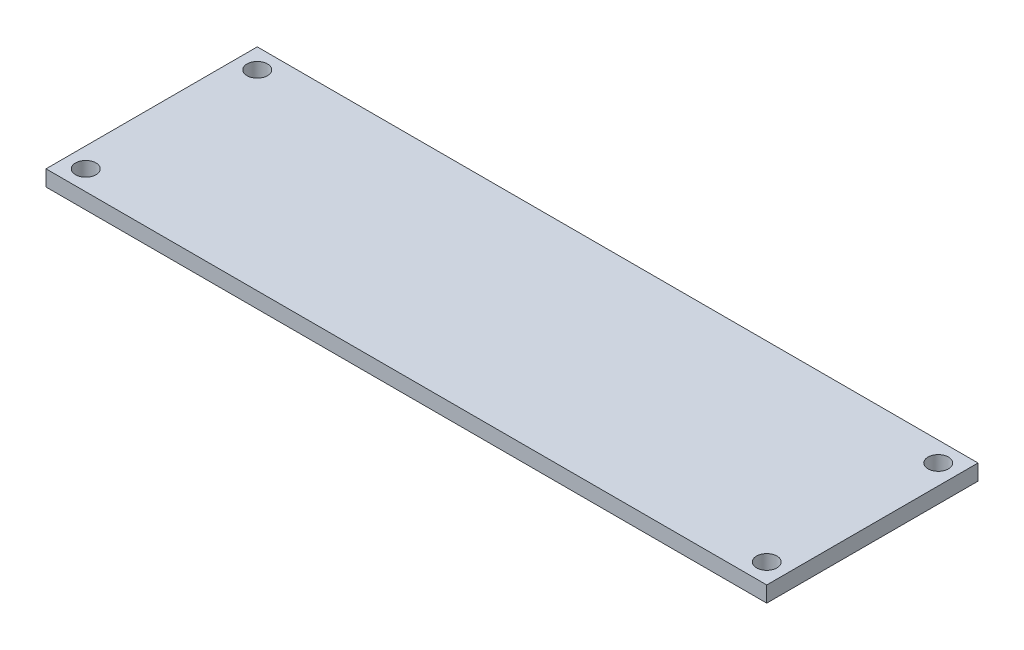
ISO-10303-21;
HEADER;
FILE_DESCRIPTION(('STEP AP214'),'2;1');
FILE_NAME('part.step','',(''),(''),'','','');
FILE_SCHEMA(('AUTOMOTIVE_DESIGN { 1 0 10303 214 1 1 1 1 }'));
ENDSEC;
DATA;
#1=APPLICATION_CONTEXT('core data for automotive mechanical design processes');
#2=APPLICATION_PROTOCOL_DEFINITION('international standard','automotive_design',2000,#1);
#3=PRODUCT_CONTEXT('',#1,'mechanical');
#4=PRODUCT('Part','Part','',(#3));
#5=PRODUCT_RELATED_PRODUCT_CATEGORY('part','',(#4));
#6=PRODUCT_DEFINITION_FORMATION('','',#4);
#7=PRODUCT_DEFINITION_CONTEXT('part definition',#1,'design');
#8=PRODUCT_DEFINITION('design','',#6,#7);
#9=PRODUCT_DEFINITION_SHAPE('','',#8);
#10=(LENGTH_UNIT() NAMED_UNIT(*) SI_UNIT(.MILLI.,.METRE.));
#11=(NAMED_UNIT(*) PLANE_ANGLE_UNIT() SI_UNIT($,.RADIAN.));
#12=(NAMED_UNIT(*) SI_UNIT($,.STERADIAN.) SOLID_ANGLE_UNIT());
#13=UNCERTAINTY_MEASURE_WITH_UNIT(LENGTH_MEASURE(1.E-05),#10,'distance_accuracy_value','');
#14=(GEOMETRIC_REPRESENTATION_CONTEXT(3) GLOBAL_UNCERTAINTY_ASSIGNED_CONTEXT((#13)) GLOBAL_UNIT_ASSIGNED_CONTEXT((#10,
#11,#12)) REPRESENTATION_CONTEXT('',''));
#15=CARTESIAN_POINT('',(0.,0.,0.));
#16=DIRECTION('',(0.,0.,1.));
#17=DIRECTION('',(1.,0.,0.));
#18=AXIS2_PLACEMENT_3D('',#15,#16,#17);
#19=CARTESIAN_POINT('',(-47.1527497782251,-0.635,0.));
#20=DIRECTION('',(0.,1.,0.));
#21=DIRECTION('',(0.,0.,1.));
#22=AXIS2_PLACEMENT_3D('',#19,#20,#21);
#23=PLANE('',#22);
#24=DIRECTION('',(0.,0.,1.));
#25=VECTOR('',#24,1.);
#26=CARTESIAN_POINT('',(-29.,-0.635,0.));
#27=LINE('',#26,#25);
#28=CARTESIAN_POINT('',(-29.,-0.635,-8.5));
#29=VERTEX_POINT('',#28);
#30=CARTESIAN_POINT('',(-29.,-0.635,8.5));
#31=VERTEX_POINT('',#30);
#32=EDGE_CURVE('E206',#29,#31,#27,.T.);
#33=ORIENTED_EDGE('',*,*,#32,.F.);
#34=DIRECTION('',(-1.,0.,0.));
#35=VECTOR('',#34,1.);
#36=CARTESIAN_POINT('',(-47.1527497782251,-0.635,-8.5));
#37=LINE('',#36,#35);
#38=CARTESIAN_POINT('',(29.,-0.635,-8.5));
#39=VERTEX_POINT('',#38);
#40=EDGE_CURVE('E55',#39,#29,#37,.T.);
#41=ORIENTED_EDGE('',*,*,#40,.F.);
#42=DIRECTION('',(0.,0.,1.));
#43=VECTOR('',#42,1.);
#44=CARTESIAN_POINT('',(29.,-0.635,0.));
#45=LINE('',#44,#43);
#46=CARTESIAN_POINT('',(29.,-0.635,8.5));
#47=VERTEX_POINT('',#46);
#48=EDGE_CURVE('E70',#39,#47,#45,.T.);
#49=ORIENTED_EDGE('',*,*,#48,.T.);
#50=DIRECTION('',(-1.,0.,0.));
#51=VECTOR('',#50,1.);
#52=CARTESIAN_POINT('',(-47.1527497782251,-0.635,8.5));
#53=LINE('',#52,#51);
#54=EDGE_CURVE('E60',#47,#31,#53,.T.);
#55=ORIENTED_EDGE('',*,*,#54,.T.);
#56=EDGE_LOOP('',(#33,#41,#49,#55));
#57=FACE_BOUND('',#56,.T.);
#58=CARTESIAN_POINT('',(27.4,-0.635,-6.9));
#59=DIRECTION('',(0.,-1.,0.));
#60=DIRECTION('',(0.,0.,-1.));
#61=AXIS2_PLACEMENT_3D('',#58,#59,#60);
#62=CIRCLE('',#61,0.825000000000001);
#63=CARTESIAN_POINT('',(27.4,-0.635,-7.725));
#64=VERTEX_POINT('',#63);
#65=EDGE_CURVE('E68',#64,#64,#62,.F.);
#66=ORIENTED_EDGE('',*,*,#65,.T.);
#67=EDGE_LOOP('',(#66));
#68=FACE_BOUND('',#67,.T.);
#69=CARTESIAN_POINT('',(27.4,-0.635,6.9));
#70=DIRECTION('',(0.,-1.,0.));
#71=DIRECTION('',(0.,0.,-1.));
#72=AXIS2_PLACEMENT_3D('',#69,#70,#71);
#73=CIRCLE('',#72,0.825000000000001);
#74=CARTESIAN_POINT('',(27.4,-0.635,6.075));
#75=VERTEX_POINT('',#74);
#76=EDGE_CURVE('E97',#75,#75,#73,.F.);
#77=ORIENTED_EDGE('',*,*,#76,.T.);
#78=EDGE_LOOP('',(#77));
#79=FACE_BOUND('',#78,.T.);
#80=CARTESIAN_POINT('',(-27.4,-0.635,-6.9));
#81=DIRECTION('',(0.,-1.,0.));
#82=DIRECTION('',(0.,0.,-1.));
#83=AXIS2_PLACEMENT_3D('',#80,#81,#82);
#84=CIRCLE('',#83,0.825000000000001);
#85=CARTESIAN_POINT('',(-27.4,-0.635,-7.725));
#86=VERTEX_POINT('',#85);
#87=EDGE_CURVE('E99',#86,#86,#84,.F.);
#88=ORIENTED_EDGE('',*,*,#87,.T.);
#89=EDGE_LOOP('',(#88));
#90=FACE_BOUND('',#89,.T.);
#91=CARTESIAN_POINT('',(-27.4,-0.635,6.9));
#92=DIRECTION('',(0.,-1.,0.));
#93=DIRECTION('',(0.,0.,-1.));
#94=AXIS2_PLACEMENT_3D('',#91,#92,#93);
#95=CIRCLE('',#94,0.825000000000001);
#96=CARTESIAN_POINT('',(-27.4,-0.635,6.075));
#97=VERTEX_POINT('',#96);
#98=EDGE_CURVE('E20',#97,#97,#95,.F.);
#99=ORIENTED_EDGE('',*,*,#98,.T.);
#100=EDGE_LOOP('',(#99));
#101=FACE_BOUND('',#100,.T.);
#102=ADVANCED_FACE('F17',(#57,#68,#79,#90,#101),#23,.F.);
#103=CARTESIAN_POINT('',(-27.4,0.635,6.9));
#104=DIRECTION('',(0.,-1.,0.));
#105=DIRECTION('',(0.,0.,-1.));
#106=AXIS2_PLACEMENT_3D('',#103,#104,#105);
#107=CYLINDRICAL_SURFACE('',#106,0.825000000000001);
#108=CARTESIAN_POINT('',(-27.4,0.635,6.9));
#109=DIRECTION('',(0.,-1.,0.));
#110=DIRECTION('',(0.,0.,-1.));
#111=AXIS2_PLACEMENT_3D('',#108,#109,#110);
#112=CIRCLE('',#111,0.825000000000001);
#113=CARTESIAN_POINT('',(-27.4,0.635,6.075));
#114=VERTEX_POINT('',#113);
#115=EDGE_CURVE('E92',#114,#114,#112,.T.);
#116=ORIENTED_EDGE('',*,*,#115,.F.);
#117=EDGE_LOOP('',(#116));
#118=FACE_BOUND('',#117,.T.);
#119=ORIENTED_EDGE('',*,*,#98,.F.);
#120=EDGE_LOOP('',(#119));
#121=FACE_BOUND('',#120,.T.);
#122=ADVANCED_FACE('F107',(#118,#121),#107,.F.);
#123=CARTESIAN_POINT('',(-27.4,0.635,-6.9));
#124=DIRECTION('',(0.,-1.,0.));
#125=DIRECTION('',(0.,0.,-1.));
#126=AXIS2_PLACEMENT_3D('',#123,#124,#125);
#127=CYLINDRICAL_SURFACE('',#126,0.825000000000001);
#128=CARTESIAN_POINT('',(-27.4,0.635,-6.9));
#129=DIRECTION('',(0.,-1.,0.));
#130=DIRECTION('',(0.,0.,-1.));
#131=AXIS2_PLACEMENT_3D('',#128,#129,#130);
#132=CIRCLE('',#131,0.825000000000001);
#133=CARTESIAN_POINT('',(-27.4,0.635,-7.725));
#134=VERTEX_POINT('',#133);
#135=EDGE_CURVE('E89',#134,#134,#132,.T.);
#136=ORIENTED_EDGE('',*,*,#135,.F.);
#137=EDGE_LOOP('',(#136));
#138=FACE_BOUND('',#137,.T.);
#139=ORIENTED_EDGE('',*,*,#87,.F.);
#140=EDGE_LOOP('',(#139));
#141=FACE_BOUND('',#140,.T.);
#142=ADVANCED_FACE('F109',(#138,#141),#127,.F.);
#143=CARTESIAN_POINT('',(27.4,0.635,6.9));
#144=DIRECTION('',(0.,-1.,0.));
#145=DIRECTION('',(0.,0.,-1.));
#146=AXIS2_PLACEMENT_3D('',#143,#144,#145);
#147=CYLINDRICAL_SURFACE('',#146,0.825000000000001);
#148=CARTESIAN_POINT('',(27.4,0.635,6.9));
#149=DIRECTION('',(0.,-1.,0.));
#150=DIRECTION('',(0.,0.,-1.));
#151=AXIS2_PLACEMENT_3D('',#148,#149,#150);
#152=CIRCLE('',#151,0.825000000000001);
#153=CARTESIAN_POINT('',(27.4,0.635,6.075));
#154=VERTEX_POINT('',#153);
#155=EDGE_CURVE('E86',#154,#154,#152,.T.);
#156=ORIENTED_EDGE('',*,*,#155,.F.);
#157=EDGE_LOOP('',(#156));
#158=FACE_BOUND('',#157,.T.);
#159=ORIENTED_EDGE('',*,*,#76,.F.);
#160=EDGE_LOOP('',(#159));
#161=FACE_BOUND('',#160,.T.);
#162=ADVANCED_FACE('F116',(#158,#161),#147,.F.);
#163=CARTESIAN_POINT('',(27.4,0.635,-6.9));
#164=DIRECTION('',(0.,-1.,0.));
#165=DIRECTION('',(0.,0.,-1.));
#166=AXIS2_PLACEMENT_3D('',#163,#164,#165);
#167=CYLINDRICAL_SURFACE('',#166,0.825000000000001);
#168=CARTESIAN_POINT('',(27.4,0.635,-6.9));
#169=DIRECTION('',(0.,-1.,0.));
#170=DIRECTION('',(0.,0.,-1.));
#171=AXIS2_PLACEMENT_3D('',#168,#169,#170);
#172=CIRCLE('',#171,0.825000000000001);
#173=CARTESIAN_POINT('',(27.4,0.635,-7.725));
#174=VERTEX_POINT('',#173);
#175=EDGE_CURVE('E82',#174,#174,#172,.T.);
#176=ORIENTED_EDGE('',*,*,#175,.F.);
#177=EDGE_LOOP('',(#176));
#178=FACE_BOUND('',#177,.T.);
#179=ORIENTED_EDGE('',*,*,#65,.F.);
#180=EDGE_LOOP('',(#179));
#181=FACE_BOUND('',#180,.T.);
#182=ADVANCED_FACE('F140',(#178,#181),#167,.F.);
#183=CARTESIAN_POINT('',(-47.1527497782251,0.635,8.5));
#184=DIRECTION('',(0.,0.,-1.));
#185=DIRECTION('',(-1.,0.,0.));
#186=AXIS2_PLACEMENT_3D('',#183,#184,#185);
#187=PLANE('',#186);
#188=DIRECTION('',(0.,1.,0.));
#189=VECTOR('',#188,1.);
#190=CARTESIAN_POINT('',(29.,0.635,8.5));
#191=LINE('',#190,#189);
#192=CARTESIAN_POINT('',(29.,0.635,8.5));
#193=VERTEX_POINT('',#192);
#194=EDGE_CURVE('E63',#47,#193,#191,.T.);
#195=ORIENTED_EDGE('',*,*,#194,.T.);
#196=DIRECTION('',(1.,0.,0.));
#197=VECTOR('',#196,1.);
#198=CARTESIAN_POINT('',(-47.1527497782251,0.635,8.5));
#199=LINE('',#198,#197);
#200=CARTESIAN_POINT('',(-29.,0.635,8.5));
#201=VERTEX_POINT('',#200);
#202=EDGE_CURVE('E85',#201,#193,#199,.T.);
#203=ORIENTED_EDGE('',*,*,#202,.F.);
#204=DIRECTION('',(0.,1.,0.));
#205=VECTOR('',#204,1.);
#206=CARTESIAN_POINT('',(-29.,0.635,8.5));
#207=LINE('',#206,#205);
#208=EDGE_CURVE('E66',#31,#201,#207,.T.);
#209=ORIENTED_EDGE('',*,*,#208,.F.);
#210=ORIENTED_EDGE('',*,*,#54,.F.);
#211=EDGE_LOOP('',(#195,#203,#209,#210));
#212=FACE_BOUND('',#211,.T.);
#213=ADVANCED_FACE('F61',(#212),#187,.F.);
#214=CARTESIAN_POINT('',(29.,0.635,0.));
#215=DIRECTION('',(-1.,0.,0.));
#216=DIRECTION('',(0.,0.,1.));
#217=AXIS2_PLACEMENT_3D('',#214,#215,#216);
#218=PLANE('',#217);
#219=DIRECTION('',(0.,1.,0.));
#220=VECTOR('',#219,1.);
#221=CARTESIAN_POINT('',(29.,0.635,-8.5));
#222=LINE('',#221,#220);
#223=CARTESIAN_POINT('',(29.,0.635,-8.5));
#224=VERTEX_POINT('',#223);
#225=EDGE_CURVE('E199',#224,#39,#222,.F.);
#226=ORIENTED_EDGE('',*,*,#225,.F.);
#227=DIRECTION('',(0.,0.,1.));
#228=VECTOR('',#227,1.);
#229=CARTESIAN_POINT('',(29.,0.635,0.));
#230=LINE('',#229,#228);
#231=EDGE_CURVE('E77',#193,#224,#230,.F.);
#232=ORIENTED_EDGE('',*,*,#231,.F.);
#233=ORIENTED_EDGE('',*,*,#194,.F.);
#234=ORIENTED_EDGE('',*,*,#48,.F.);
#235=EDGE_LOOP('',(#226,#232,#233,#234));
#236=FACE_BOUND('',#235,.T.);
#237=ADVANCED_FACE('F75',(#236),#218,.F.);
#238=CARTESIAN_POINT('',(-47.1527497782251,0.635,-8.5));
#239=DIRECTION('',(0.,0.,-1.));
#240=DIRECTION('',(-1.,0.,0.));
#241=AXIS2_PLACEMENT_3D('',#238,#239,#240);
#242=PLANE('',#241);
#243=DIRECTION('',(1.,0.,0.));
#244=VECTOR('',#243,1.);
#245=CARTESIAN_POINT('',(-47.1527497782251,0.635,-8.5));
#246=LINE('',#245,#244);
#247=CARTESIAN_POINT('',(-29.,0.635,-8.5));
#248=VERTEX_POINT('',#247);
#249=EDGE_CURVE('E26',#224,#248,#246,.F.);
#250=ORIENTED_EDGE('',*,*,#249,.F.);
#251=ORIENTED_EDGE('',*,*,#225,.T.);
#252=ORIENTED_EDGE('',*,*,#40,.T.);
#253=DIRECTION('',(0.,1.,0.));
#254=VECTOR('',#253,1.);
#255=CARTESIAN_POINT('',(-29.,0.635,-8.5));
#256=LINE('',#255,#254);
#257=EDGE_CURVE('E35',#248,#29,#256,.F.);
#258=ORIENTED_EDGE('',*,*,#257,.F.);
#259=EDGE_LOOP('',(#250,#251,#252,#258));
#260=FACE_BOUND('',#259,.T.);
#261=ADVANCED_FACE('F128',(#260),#242,.T.);
#262=CARTESIAN_POINT('',(-29.,0.635,0.));
#263=DIRECTION('',(-1.,0.,0.));
#264=DIRECTION('',(0.,0.,1.));
#265=AXIS2_PLACEMENT_3D('',#262,#263,#264);
#266=PLANE('',#265);
#267=DIRECTION('',(0.,0.,1.));
#268=VECTOR('',#267,1.);
#269=CARTESIAN_POINT('',(-29.,0.635,0.));
#270=LINE('',#269,#268);
#271=EDGE_CURVE('E11',#248,#201,#270,.T.);
#272=ORIENTED_EDGE('',*,*,#271,.F.);
#273=ORIENTED_EDGE('',*,*,#257,.T.);
#274=ORIENTED_EDGE('',*,*,#32,.T.);
#275=ORIENTED_EDGE('',*,*,#208,.T.);
#276=EDGE_LOOP('',(#272,#273,#274,#275));
#277=FACE_BOUND('',#276,.T.);
#278=ADVANCED_FACE('F122',(#277),#266,.T.);
#279=CARTESIAN_POINT('',(-47.1527497782251,0.635,0.));
#280=DIRECTION('',(0.,1.,0.));
#281=DIRECTION('',(0.,0.,1.));
#282=AXIS2_PLACEMENT_3D('',#279,#280,#281);
#283=PLANE('',#282);
#284=ORIENTED_EDGE('',*,*,#249,.T.);
#285=ORIENTED_EDGE('',*,*,#271,.T.);
#286=ORIENTED_EDGE('',*,*,#202,.T.);
#287=ORIENTED_EDGE('',*,*,#231,.T.);
#288=EDGE_LOOP('',(#284,#285,#286,#287));
#289=FACE_BOUND('',#288,.T.);
#290=ORIENTED_EDGE('',*,*,#175,.T.);
#291=EDGE_LOOP('',(#290));
#292=FACE_BOUND('',#291,.T.);
#293=ORIENTED_EDGE('',*,*,#155,.T.);
#294=EDGE_LOOP('',(#293));
#295=FACE_BOUND('',#294,.T.);
#296=ORIENTED_EDGE('',*,*,#135,.T.);
#297=EDGE_LOOP('',(#296));
#298=FACE_BOUND('',#297,.T.);
#299=ORIENTED_EDGE('',*,*,#115,.T.);
#300=EDGE_LOOP('',(#299));
#301=FACE_BOUND('',#300,.T.);
#302=ADVANCED_FACE('F120',(#289,#292,#295,#298,#301),#283,.T.);
#303=CLOSED_SHELL('',(#102,#122,#142,#162,#182,#213,#237,#261,#278,#302));
#304=MANIFOLD_SOLID_BREP('B1',#303);
#305=ADVANCED_BREP_SHAPE_REPRESENTATION('',(#18,#304),#14);
#306=SHAPE_DEFINITION_REPRESENTATION(#9,#305);
ENDSEC;
END-ISO-10303-21;
